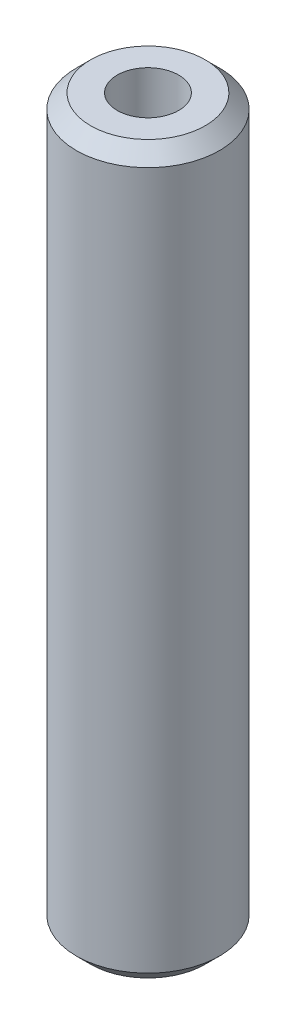
ISO-10303-21;
HEADER;
FILE_DESCRIPTION(('STEP AP214'),'2;1');
FILE_NAME('part.step','',(''),(''),'','','');
FILE_SCHEMA(('AUTOMOTIVE_DESIGN { 1 0 10303 214 1 1 1 1 }'));
ENDSEC;
DATA;
#1=APPLICATION_CONTEXT('core data for automotive mechanical design processes');
#2=APPLICATION_PROTOCOL_DEFINITION('international standard','automotive_design',2000,#1);
#3=PRODUCT_CONTEXT('',#1,'mechanical');
#4=PRODUCT('Part','Part','',(#3));
#5=PRODUCT_RELATED_PRODUCT_CATEGORY('part','',(#4));
#6=PRODUCT_DEFINITION_FORMATION('','',#4);
#7=PRODUCT_DEFINITION_CONTEXT('part definition',#1,'design');
#8=PRODUCT_DEFINITION('design','',#6,#7);
#9=PRODUCT_DEFINITION_SHAPE('','',#8);
#10=(LENGTH_UNIT() NAMED_UNIT(*) SI_UNIT(.MILLI.,.METRE.));
#11=(NAMED_UNIT(*) PLANE_ANGLE_UNIT() SI_UNIT($,.RADIAN.));
#12=(NAMED_UNIT(*) SI_UNIT($,.STERADIAN.) SOLID_ANGLE_UNIT());
#13=UNCERTAINTY_MEASURE_WITH_UNIT(LENGTH_MEASURE(1.E-05),#10,'distance_accuracy_value','');
#14=(GEOMETRIC_REPRESENTATION_CONTEXT(3) GLOBAL_UNCERTAINTY_ASSIGNED_CONTEXT((#13)) GLOBAL_UNIT_ASSIGNED_CONTEXT((#10,
#11,#12)) REPRESENTATION_CONTEXT('',''));
#15=CARTESIAN_POINT('',(0.,0.,0.));
#16=DIRECTION('',(0.,0.,1.));
#17=DIRECTION('',(1.,0.,0.));
#18=AXIS2_PLACEMENT_3D('',#15,#16,#17);
#19=CARTESIAN_POINT('',(0.,253.670663536825,0.));
#20=DIRECTION('',(0.,-1.,0.));
#21=DIRECTION('',(0.,0.,-1.));
#22=AXIS2_PLACEMENT_3D('',#19,#20,#21);
#23=CYLINDRICAL_SURFACE('',#22,25.);
#24=CARTESIAN_POINT('',(0.,248.673026203868,0.));
#25=DIRECTION('',(0.,1.,0.));
#26=DIRECTION('',(0.,0.,1.));
#27=AXIS2_PLACEMENT_3D('',#24,#25,#26);
#28=CIRCLE('',#27,25.);
#29=CARTESIAN_POINT('',(0.,248.673026203868,25.));
#30=VERTEX_POINT('',#29);
#31=EDGE_CURVE('E50',#30,#30,#28,.F.);
#32=ORIENTED_EDGE('',*,*,#31,.T.);
#33=EDGE_LOOP('',(#32));
#34=FACE_BOUND('',#33,.T.);
#35=CARTESIAN_POINT('',(0.,4.99763733295766,0.));
#36=DIRECTION('',(0.,1.,0.));
#37=DIRECTION('',(0.,0.,1.));
#38=AXIS2_PLACEMENT_3D('',#35,#36,#37);
#39=CIRCLE('',#38,25.);
#40=CARTESIAN_POINT('',(0.,4.99763733295766,25.));
#41=VERTEX_POINT('',#40);
#42=EDGE_CURVE('E51',#41,#41,#39,.T.);
#43=ORIENTED_EDGE('',*,*,#42,.T.);
#44=EDGE_LOOP('',(#43));
#45=FACE_BOUND('',#44,.T.);
#46=ADVANCED_FACE('F39',(#34,#45),#23,.T.);
#47=CARTESIAN_POINT('',(0.,253.670663536825,0.));
#48=DIRECTION('',(0.,1.,0.));
#49=DIRECTION('',(0.,0.,1.));
#50=AXIS2_PLACEMENT_3D('',#47,#48,#49);
#51=PLANE('',#50);
#52=CARTESIAN_POINT('',(0.,253.670663536825,0.));
#53=DIRECTION('',(0.,1.,0.));
#54=DIRECTION('',(0.,0.,1.));
#55=AXIS2_PLACEMENT_3D('',#52,#53,#54);
#56=CIRCLE('',#55,20.0023626670423);
#57=CARTESIAN_POINT('',(0.,253.670663536825,20.0023626670423));
#58=VERTEX_POINT('',#57);
#59=EDGE_CURVE('E54',#58,#58,#56,.T.);
#60=ORIENTED_EDGE('',*,*,#59,.T.);
#61=EDGE_LOOP('',(#60));
#62=FACE_BOUND('',#61,.T.);
#63=CARTESIAN_POINT('',(0.,253.670663536825,0.));
#64=DIRECTION('',(0.,1.,0.));
#65=DIRECTION('',(0.,0.,1.));
#66=AXIS2_PLACEMENT_3D('',#63,#64,#65);
#67=CIRCLE('',#66,10.7359491640159);
#68=CARTESIAN_POINT('',(0.,253.670663536825,10.7359491640159));
#69=VERTEX_POINT('',#68);
#70=EDGE_CURVE('E58',#69,#69,#67,.T.);
#71=ORIENTED_EDGE('',*,*,#70,.F.);
#72=EDGE_LOOP('',(#71));
#73=FACE_BOUND('',#72,.T.);
#74=ADVANCED_FACE('F69',(#62,#73),#51,.T.);
#75=CARTESIAN_POINT('',(0.,0.,0.));
#76=DIRECTION('',(0.,1.,0.));
#77=DIRECTION('',(0.,0.,1.));
#78=AXIS2_PLACEMENT_3D('',#75,#76,#77);
#79=PLANE('',#78);
#80=CARTESIAN_POINT('',(0.,0.,0.));
#81=DIRECTION('',(0.,1.,0.));
#82=DIRECTION('',(0.,0.,1.));
#83=AXIS2_PLACEMENT_3D('',#80,#81,#82);
#84=CIRCLE('',#83,20.0023626670423);
#85=CARTESIAN_POINT('',(0.,0.,20.0023626670423));
#86=VERTEX_POINT('',#85);
#87=EDGE_CURVE('E10',#86,#86,#84,.F.);
#88=ORIENTED_EDGE('',*,*,#87,.T.);
#89=EDGE_LOOP('',(#88));
#90=FACE_BOUND('',#89,.T.);
#91=CARTESIAN_POINT('',(0.,0.,0.));
#92=DIRECTION('',(0.,1.,0.));
#93=DIRECTION('',(0.,0.,1.));
#94=AXIS2_PLACEMENT_3D('',#91,#92,#93);
#95=CIRCLE('',#94,10.7359491640159);
#96=CARTESIAN_POINT('',(0.,0.,10.7359491640159));
#97=VERTEX_POINT('',#96);
#98=EDGE_CURVE('E63',#97,#97,#95,.T.);
#99=ORIENTED_EDGE('',*,*,#98,.T.);
#100=EDGE_LOOP('',(#99));
#101=FACE_BOUND('',#100,.T.);
#102=ADVANCED_FACE('F75',(#90,#101),#79,.F.);
#103=CARTESIAN_POINT('',(0.,253.670663536825,0.));
#104=DIRECTION('',(0.,-1.,0.));
#105=DIRECTION('',(0.,0.,-1.));
#106=AXIS2_PLACEMENT_3D('',#103,#104,#105);
#107=CYLINDRICAL_SURFACE('',#106,10.7359491640159);
#108=ORIENTED_EDGE('',*,*,#70,.T.);
#109=EDGE_LOOP('',(#108));
#110=FACE_BOUND('',#109,.T.);
#111=ORIENTED_EDGE('',*,*,#98,.F.);
#112=EDGE_LOOP('',(#111));
#113=FACE_BOUND('',#112,.T.);
#114=ADVANCED_FACE('F70',(#110,#113),#107,.F.);
#115=CARTESIAN_POINT('',(0.,253.670663536825,0.));
#116=DIRECTION('',(0.,-1.,0.));
#117=DIRECTION('',(0.,0.,-1.));
#118=AXIS2_PLACEMENT_3D('',#115,#116,#117);
#119=CONICAL_SURFACE('',#118,20.0023626670423,0.785398163397444);
#120=ORIENTED_EDGE('',*,*,#31,.F.);
#121=EDGE_LOOP('',(#120));
#122=FACE_BOUND('',#121,.T.);
#123=ORIENTED_EDGE('',*,*,#59,.F.);
#124=EDGE_LOOP('',(#123));
#125=FACE_BOUND('',#124,.T.);
#126=ADVANCED_FACE('F81',(#122,#125),#119,.T.);
#127=CARTESIAN_POINT('',(0.,4.99763733295766,0.));
#128=DIRECTION('',(0.,1.,0.));
#129=DIRECTION('',(0.,0.,1.));
#130=AXIS2_PLACEMENT_3D('',#127,#128,#129);
#131=CONICAL_SURFACE('',#130,25.,0.785398163397449);
#132=ORIENTED_EDGE('',*,*,#87,.F.);
#133=EDGE_LOOP('',(#132));
#134=FACE_BOUND('',#133,.T.);
#135=ORIENTED_EDGE('',*,*,#42,.F.);
#136=EDGE_LOOP('',(#135));
#137=FACE_BOUND('',#136,.T.);
#138=ADVANCED_FACE('F45',(#134,#137),#131,.T.);
#139=CLOSED_SHELL('',(#46,#74,#102,#114,#126,#138));
#140=MANIFOLD_SOLID_BREP('B2',#139);
#141=ADVANCED_BREP_SHAPE_REPRESENTATION('',(#18,#140),#14);
#142=SHAPE_DEFINITION_REPRESENTATION(#9,#141);
ENDSEC;
END-ISO-10303-21;
